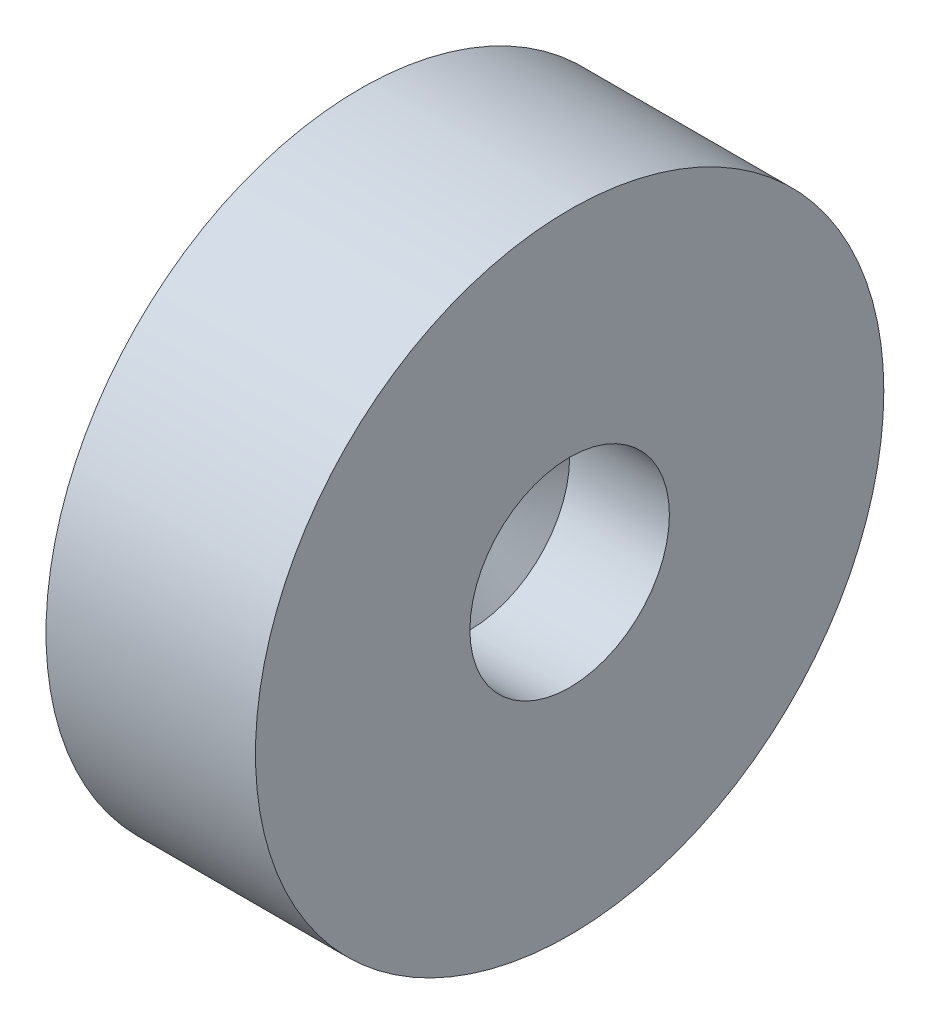
ISO-10303-21;
HEADER;
FILE_DESCRIPTION(('STEP AP214'),'2;1');
FILE_NAME('part.step','',(''),(''),'','','');
FILE_SCHEMA(('AUTOMOTIVE_DESIGN { 1 0 10303 214 1 1 1 1 }'));
ENDSEC;
DATA;
#1=APPLICATION_CONTEXT('core data for automotive mechanical design processes');
#2=APPLICATION_PROTOCOL_DEFINITION('international standard','automotive_design',2000,#1);
#3=PRODUCT_CONTEXT('',#1,'mechanical');
#4=PRODUCT('Part','Part','',(#3));
#5=PRODUCT_RELATED_PRODUCT_CATEGORY('part','',(#4));
#6=PRODUCT_DEFINITION_FORMATION('','',#4);
#7=PRODUCT_DEFINITION_CONTEXT('part definition',#1,'design');
#8=PRODUCT_DEFINITION('design','',#6,#7);
#9=PRODUCT_DEFINITION_SHAPE('','',#8);
#10=(LENGTH_UNIT() NAMED_UNIT(*) SI_UNIT(.MILLI.,.METRE.));
#11=(NAMED_UNIT(*) PLANE_ANGLE_UNIT() SI_UNIT($,.RADIAN.));
#12=(NAMED_UNIT(*) SI_UNIT($,.STERADIAN.) SOLID_ANGLE_UNIT());
#13=UNCERTAINTY_MEASURE_WITH_UNIT(LENGTH_MEASURE(1.E-05),#10,'distance_accuracy_value','');
#14=(GEOMETRIC_REPRESENTATION_CONTEXT(3) GLOBAL_UNCERTAINTY_ASSIGNED_CONTEXT((#13)) GLOBAL_UNIT_ASSIGNED_CONTEXT((#10,
#11,#12)) REPRESENTATION_CONTEXT('',''));
#15=CARTESIAN_POINT('',(0.,0.,0.));
#16=DIRECTION('',(0.,0.,1.));
#17=DIRECTION('',(1.,0.,0.));
#18=AXIS2_PLACEMENT_3D('',#15,#16,#17);
#19=CARTESIAN_POINT('',(10.,0.,0.));
#20=DIRECTION('',(-1.,0.,0.));
#21=DIRECTION('',(0.,0.,1.));
#22=AXIS2_PLACEMENT_3D('',#19,#20,#21);
#23=CYLINDRICAL_SURFACE('',#22,15.);
#24=CARTESIAN_POINT('',(10.,0.,0.));
#25=DIRECTION('',(1.,0.,0.));
#26=DIRECTION('',(0.,0.,-1.));
#27=AXIS2_PLACEMENT_3D('',#24,#25,#26);
#28=CIRCLE('',#27,15.);
#29=CARTESIAN_POINT('',(10.,0.,-15.));
#30=VERTEX_POINT('',#29);
#31=EDGE_CURVE('E11',#30,#30,#28,.T.);
#32=ORIENTED_EDGE('',*,*,#31,.F.);
#33=EDGE_LOOP('',(#32));
#34=FACE_BOUND('',#33,.T.);
#35=CARTESIAN_POINT('',(0.,0.,0.));
#36=DIRECTION('',(1.,0.,0.));
#37=DIRECTION('',(0.,0.,-1.));
#38=AXIS2_PLACEMENT_3D('',#35,#36,#37);
#39=CIRCLE('',#38,15.);
#40=CARTESIAN_POINT('',(0.,0.,-15.));
#41=VERTEX_POINT('',#40);
#42=EDGE_CURVE('E48',#41,#41,#39,.T.);
#43=ORIENTED_EDGE('',*,*,#42,.T.);
#44=EDGE_LOOP('',(#43));
#45=FACE_BOUND('',#44,.T.);
#46=ADVANCED_FACE('F45',(#34,#45),#23,.T.);
#47=CARTESIAN_POINT('',(10.,0.,0.));
#48=DIRECTION('',(1.,0.,0.));
#49=DIRECTION('',(0.,0.,-1.));
#50=AXIS2_PLACEMENT_3D('',#47,#48,#49);
#51=PLANE('',#50);
#52=CARTESIAN_POINT('',(10.,0.,0.));
#53=DIRECTION('',(1.,0.,0.));
#54=DIRECTION('',(0.,0.,-1.));
#55=AXIS2_PLACEMENT_3D('',#52,#53,#54);
#56=CIRCLE('',#55,4.7625);
#57=CARTESIAN_POINT('',(10.,0.,-4.7625));
#58=VERTEX_POINT('',#57);
#59=EDGE_CURVE('E123',#58,#58,#56,.T.);
#60=ORIENTED_EDGE('',*,*,#59,.F.);
#61=EDGE_LOOP('',(#60));
#62=FACE_BOUND('',#61,.T.);
#63=ORIENTED_EDGE('',*,*,#31,.T.);
#64=EDGE_LOOP('',(#63));
#65=FACE_BOUND('',#64,.T.);
#66=ADVANCED_FACE('F152',(#62,#65),#51,.T.);
#67=CARTESIAN_POINT('',(0.,0.,0.));
#68=DIRECTION('',(1.,0.,0.));
#69=DIRECTION('',(0.,0.,-1.));
#70=AXIS2_PLACEMENT_3D('',#67,#68,#69);
#71=PLANE('',#70);
#72=DIRECTION('',(0.,0.,-1.));
#73=VECTOR('',#72,1.);
#74=CARTESIAN_POINT('',(0.,7.5,-7.5));
#75=LINE('',#74,#73);
#76=CARTESIAN_POINT('',(0.,7.5,7.5));
#77=VERTEX_POINT('',#76);
#78=CARTESIAN_POINT('',(0.,7.5,-7.5));
#79=VERTEX_POINT('',#78);
#80=EDGE_CURVE('E95',#77,#79,#75,.T.);
#81=ORIENTED_EDGE('',*,*,#80,.F.);
#82=DIRECTION('',(0.,1.,0.));
#83=VECTOR('',#82,1.);
#84=CARTESIAN_POINT('',(0.,-7.5,7.5));
#85=LINE('',#84,#83);
#86=CARTESIAN_POINT('',(0.,-7.5,7.5));
#87=VERTEX_POINT('',#86);
#88=EDGE_CURVE('E60',#87,#77,#85,.T.);
#89=ORIENTED_EDGE('',*,*,#88,.F.);
#90=DIRECTION('',(0.,0.,1.));
#91=VECTOR('',#90,1.);
#92=CARTESIAN_POINT('',(0.,-7.5,-7.5));
#93=LINE('',#92,#91);
#94=CARTESIAN_POINT('',(0.,-7.5,-7.5));
#95=VERTEX_POINT('',#94);
#96=EDGE_CURVE('E115',#95,#87,#93,.T.);
#97=ORIENTED_EDGE('',*,*,#96,.F.);
#98=DIRECTION('',(0.,-1.,0.));
#99=VECTOR('',#98,1.);
#100=CARTESIAN_POINT('',(0.,-7.5,-7.5));
#101=LINE('',#100,#99);
#102=EDGE_CURVE('E126',#79,#95,#101,.T.);
#103=ORIENTED_EDGE('',*,*,#102,.F.);
#104=EDGE_LOOP('',(#81,#89,#97,#103));
#105=FACE_BOUND('',#104,.T.);
#106=ORIENTED_EDGE('',*,*,#42,.F.);
#107=EDGE_LOOP('',(#106));
#108=FACE_BOUND('',#107,.T.);
#109=ADVANCED_FACE('F137',(#105,#108),#71,.F.);
#110=CARTESIAN_POINT('',(3.,-7.5,7.5));
#111=DIRECTION('',(0.,0.,1.));
#112=DIRECTION('',(1.,0.,0.));
#113=AXIS2_PLACEMENT_3D('',#110,#111,#112);
#114=PLANE('',#113);
#115=ORIENTED_EDGE('',*,*,#88,.T.);
#116=DIRECTION('',(-1.,0.,0.));
#117=VECTOR('',#116,1.);
#118=CARTESIAN_POINT('',(3.,7.5,7.5));
#119=LINE('',#118,#117);
#120=CARTESIAN_POINT('',(3.,7.5,7.5));
#121=VERTEX_POINT('',#120);
#122=EDGE_CURVE('E83',#121,#77,#119,.T.);
#123=ORIENTED_EDGE('',*,*,#122,.F.);
#124=DIRECTION('',(0.,1.,0.));
#125=VECTOR('',#124,1.);
#126=CARTESIAN_POINT('',(3.,-7.5,7.5));
#127=LINE('',#126,#125);
#128=CARTESIAN_POINT('',(3.,-7.5,7.5));
#129=VERTEX_POINT('',#128);
#130=EDGE_CURVE('E111',#129,#121,#127,.T.);
#131=ORIENTED_EDGE('',*,*,#130,.F.);
#132=DIRECTION('',(-1.,0.,0.));
#133=VECTOR('',#132,1.);
#134=CARTESIAN_POINT('',(3.,-7.5,7.5));
#135=LINE('',#134,#133);
#136=EDGE_CURVE('E68',#129,#87,#135,.T.);
#137=ORIENTED_EDGE('',*,*,#136,.T.);
#138=EDGE_LOOP('',(#115,#123,#131,#137));
#139=FACE_BOUND('',#138,.T.);
#140=ADVANCED_FACE('F142',(#139),#114,.F.);
#141=CARTESIAN_POINT('',(3.,-7.5,-7.5));
#142=DIRECTION('',(0.,-1.,0.));
#143=DIRECTION('',(0.,0.,-1.));
#144=AXIS2_PLACEMENT_3D('',#141,#142,#143);
#145=PLANE('',#144);
#146=ORIENTED_EDGE('',*,*,#96,.T.);
#147=ORIENTED_EDGE('',*,*,#136,.F.);
#148=DIRECTION('',(0.,0.,1.));
#149=VECTOR('',#148,1.);
#150=CARTESIAN_POINT('',(3.,-7.5,-7.5));
#151=LINE('',#150,#149);
#152=CARTESIAN_POINT('',(3.,-7.5,-7.5));
#153=VERTEX_POINT('',#152);
#154=EDGE_CURVE('E108',#153,#129,#151,.T.);
#155=ORIENTED_EDGE('',*,*,#154,.F.);
#156=DIRECTION('',(-1.,0.,0.));
#157=VECTOR('',#156,1.);
#158=CARTESIAN_POINT('',(3.,-7.5,-7.5));
#159=LINE('',#158,#157);
#160=EDGE_CURVE('E100',#153,#95,#159,.T.);
#161=ORIENTED_EDGE('',*,*,#160,.T.);
#162=EDGE_LOOP('',(#146,#147,#155,#161));
#163=FACE_BOUND('',#162,.T.);
#164=ADVANCED_FACE('F140',(#163),#145,.F.);
#165=CARTESIAN_POINT('',(3.,-7.5,-7.5));
#166=DIRECTION('',(0.,0.,-1.));
#167=DIRECTION('',(-1.,0.,0.));
#168=AXIS2_PLACEMENT_3D('',#165,#166,#167);
#169=PLANE('',#168);
#170=ORIENTED_EDGE('',*,*,#102,.T.);
#171=ORIENTED_EDGE('',*,*,#160,.F.);
#172=DIRECTION('',(0.,-1.,0.));
#173=VECTOR('',#172,1.);
#174=CARTESIAN_POINT('',(3.,-7.5,-7.5));
#175=LINE('',#174,#173);
#176=CARTESIAN_POINT('',(3.,7.5,-7.5));
#177=VERTEX_POINT('',#176);
#178=EDGE_CURVE('E103',#177,#153,#175,.T.);
#179=ORIENTED_EDGE('',*,*,#178,.F.);
#180=DIRECTION('',(-1.,0.,0.));
#181=VECTOR('',#180,1.);
#182=CARTESIAN_POINT('',(3.,7.5,-7.5));
#183=LINE('',#182,#181);
#184=EDGE_CURVE('E88',#177,#79,#183,.T.);
#185=ORIENTED_EDGE('',*,*,#184,.T.);
#186=EDGE_LOOP('',(#170,#171,#179,#185));
#187=FACE_BOUND('',#186,.T.);
#188=ADVANCED_FACE('F104',(#187),#169,.F.);
#189=CARTESIAN_POINT('',(3.,7.5,-7.5));
#190=DIRECTION('',(0.,1.,0.));
#191=DIRECTION('',(0.,0.,1.));
#192=AXIS2_PLACEMENT_3D('',#189,#190,#191);
#193=PLANE('',#192);
#194=ORIENTED_EDGE('',*,*,#80,.T.);
#195=ORIENTED_EDGE('',*,*,#184,.F.);
#196=DIRECTION('',(0.,0.,-1.));
#197=VECTOR('',#196,1.);
#198=CARTESIAN_POINT('',(3.,7.5,-7.5));
#199=LINE('',#198,#197);
#200=EDGE_CURVE('E92',#121,#177,#199,.T.);
#201=ORIENTED_EDGE('',*,*,#200,.F.);
#202=ORIENTED_EDGE('',*,*,#122,.T.);
#203=EDGE_LOOP('',(#194,#195,#201,#202));
#204=FACE_BOUND('',#203,.T.);
#205=ADVANCED_FACE('F90',(#204),#193,.F.);
#206=CARTESIAN_POINT('',(3.,0.,0.));
#207=DIRECTION('',(1.,0.,0.));
#208=DIRECTION('',(0.,0.,-1.));
#209=AXIS2_PLACEMENT_3D('',#206,#207,#208);
#210=PLANE('',#209);
#211=CARTESIAN_POINT('',(3.,0.,0.));
#212=DIRECTION('',(-1.,0.,0.));
#213=DIRECTION('',(0.,0.,1.));
#214=AXIS2_PLACEMENT_3D('',#211,#212,#213);
#215=CIRCLE('',#214,1.25);
#216=CARTESIAN_POINT('',(3.,0.,1.25));
#217=VERTEX_POINT('',#216);
#218=EDGE_CURVE('E188',#217,#217,#215,.T.);
#219=ORIENTED_EDGE('',*,*,#218,.F.);
#220=EDGE_LOOP('',(#219));
#221=FACE_BOUND('',#220,.T.);
#222=ORIENTED_EDGE('',*,*,#130,.T.);
#223=ORIENTED_EDGE('',*,*,#200,.T.);
#224=ORIENTED_EDGE('',*,*,#178,.T.);
#225=ORIENTED_EDGE('',*,*,#154,.T.);
#226=EDGE_LOOP('',(#222,#223,#224,#225));
#227=FACE_BOUND('',#226,.T.);
#228=ADVANCED_FACE('F110',(#221,#227),#210,.F.);
#229=CARTESIAN_POINT('',(5.2375,0.,0.));
#230=DIRECTION('',(1.,0.,0.));
#231=DIRECTION('',(0.,0.,-1.));
#232=AXIS2_PLACEMENT_3D('',#229,#230,#231);
#233=CYLINDRICAL_SURFACE('',#232,4.7625);
#234=CARTESIAN_POINT('',(5.2375,0.,0.));
#235=DIRECTION('',(-1.,0.,0.));
#236=DIRECTION('',(0.,0.,1.));
#237=AXIS2_PLACEMENT_3D('',#234,#235,#236);
#238=CIRCLE('',#237,4.7625);
#239=CARTESIAN_POINT('',(5.2375,0.,4.7625));
#240=VERTEX_POINT('',#239);
#241=EDGE_CURVE('E191',#240,#240,#238,.T.);
#242=ORIENTED_EDGE('',*,*,#241,.T.);
#243=EDGE_LOOP('',(#242));
#244=FACE_BOUND('',#243,.T.);
#245=ORIENTED_EDGE('',*,*,#59,.T.);
#246=EDGE_LOOP('',(#245));
#247=FACE_BOUND('',#246,.T.);
#248=ADVANCED_FACE('F172',(#244,#247),#233,.F.);
#249=CARTESIAN_POINT('',(5.2375,0.,0.));
#250=DIRECTION('',(1.,0.,0.));
#251=DIRECTION('',(0.,0.,-1.));
#252=AXIS2_PLACEMENT_3D('',#249,#250,#251);
#253=CONICAL_SURFACE('',#252,4.7625,1.00360670414738);
#254=ORIENTED_EDGE('',*,*,#218,.T.);
#255=EDGE_LOOP('',(#254));
#256=FACE_BOUND('',#255,.T.);
#257=ORIENTED_EDGE('',*,*,#241,.F.);
#258=EDGE_LOOP('',(#257));
#259=FACE_BOUND('',#258,.T.);
#260=ADVANCED_FACE('F178',(#256,#259),#253,.F.);
#261=CLOSED_SHELL('',(#46,#66,#109,#140,#164,#188,#205,#228,#248,#260));
#262=MANIFOLD_SOLID_BREP('B2',#261);
#263=ADVANCED_BREP_SHAPE_REPRESENTATION('',(#18,#262),#14);
#264=SHAPE_DEFINITION_REPRESENTATION(#9,#263);
ENDSEC;
END-ISO-10303-21;
